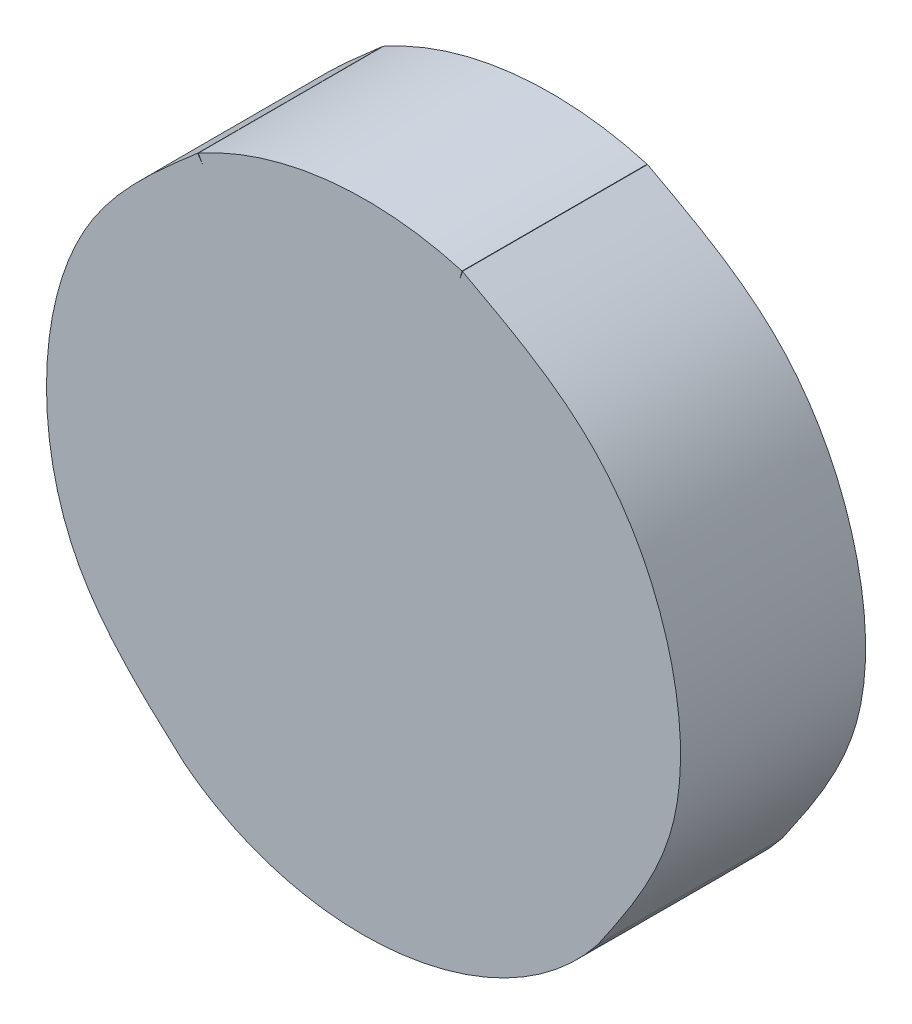
ISO-10303-21;
HEADER;
FILE_DESCRIPTION(('STEP AP214'),'2;1');
FILE_NAME('part.step','',(''),(''),'','','');
FILE_SCHEMA(('AUTOMOTIVE_DESIGN { 1 0 10303 214 1 1 1 1 }'));
ENDSEC;
DATA;
#1=APPLICATION_CONTEXT('core data for automotive mechanical design processes');
#2=APPLICATION_PROTOCOL_DEFINITION('international standard','automotive_design',2000,#1);
#3=PRODUCT_CONTEXT('',#1,'mechanical');
#4=PRODUCT('Part','Part','',(#3));
#5=PRODUCT_RELATED_PRODUCT_CATEGORY('part','',(#4));
#6=PRODUCT_DEFINITION_FORMATION('','',#4);
#7=PRODUCT_DEFINITION_CONTEXT('part definition',#1,'design');
#8=PRODUCT_DEFINITION('design','',#6,#7);
#9=PRODUCT_DEFINITION_SHAPE('','',#8);
#10=(LENGTH_UNIT() NAMED_UNIT(*) SI_UNIT(.MILLI.,.METRE.));
#11=(NAMED_UNIT(*) PLANE_ANGLE_UNIT() SI_UNIT($,.RADIAN.));
#12=(NAMED_UNIT(*) SI_UNIT($,.STERADIAN.) SOLID_ANGLE_UNIT());
#13=UNCERTAINTY_MEASURE_WITH_UNIT(LENGTH_MEASURE(1.E-05),#10,'distance_accuracy_value','');
#14=(GEOMETRIC_REPRESENTATION_CONTEXT(3) GLOBAL_UNCERTAINTY_ASSIGNED_CONTEXT((#13)) GLOBAL_UNIT_ASSIGNED_CONTEXT((#10,
#11,#12)) REPRESENTATION_CONTEXT('',''));
#15=CARTESIAN_POINT('',(0.,0.,0.));
#16=DIRECTION('',(0.,0.,1.));
#17=DIRECTION('',(1.,0.,0.));
#18=AXIS2_PLACEMENT_3D('',#15,#16,#17);
#19=CARTESIAN_POINT('',(611.633949715699,916.431323652917,1315.14694363842));
#20=DIRECTION('',(0.833552068454023,0.552440901070893,0.));
#21=DIRECTION('',(-0.552440901070893,0.833552068454023,0.));
#22=AXIS2_PLACEMENT_3D('',#19,#20,#21);
#23=PLANE('',#22);
#24=CARTESIAN_POINT('',(611.633949715699,916.431323652917,1313.40734896724));
#25=DIRECTION('',(0.552440901070893,-0.833552068454023,0.));
#26=VECTOR('',#25,1.);
#27=LINE('',#24,#26);
#28=CARTESIAN_POINT('',(611.633949715699,916.431323652917,1313.40734896724));
#29=VERTEX_POINT('',#28);
#30=CARTESIAN_POINT('',(611.681242770108,916.359965389526,1313.40734896724));
#31=VERTEX_POINT('',#30);
#32=EDGE_CURVE('E382',#29,#31,#27,.T.);
#33=ORIENTED_EDGE('',*,*,#32,.F.);
#34=CARTESIAN_POINT('',(611.633949715699,916.431323652917,1315.14694363842));
#35=DIRECTION('',(0.,0.,-1.));
#36=VECTOR('',#35,1.);
#37=LINE('',#34,#36);
#38=CARTESIAN_POINT('',(611.633949715699,916.431323652917,1315.14694363842));
#39=VERTEX_POINT('',#38);
#40=EDGE_CURVE('E35',#39,#29,#37,.T.);
#41=ORIENTED_EDGE('',*,*,#40,.F.);
#42=CARTESIAN_POINT('',(611.633949715699,916.431323652917,1315.14694363842));
#43=DIRECTION('',(0.552440901070893,-0.833552068454023,0.));
#44=VECTOR('',#43,1.);
#45=LINE('',#42,#44);
#46=CARTESIAN_POINT('',(611.681242770108,916.359965389526,1315.14694363842));
#47=VERTEX_POINT('',#46);
#48=EDGE_CURVE('E202',#39,#47,#45,.T.);
#49=ORIENTED_EDGE('',*,*,#48,.T.);
#50=CARTESIAN_POINT('',(611.681242770108,916.359965389526,1315.14694363842));
#51=DIRECTION('',(0.,0.,-1.));
#52=VECTOR('',#51,1.);
#53=LINE('',#50,#52);
#54=EDGE_CURVE('E10',#47,#31,#53,.T.);
#55=ORIENTED_EDGE('',*,*,#54,.T.);
#56=EDGE_LOOP('',(#33,#41,#49,#55));
#57=FACE_BOUND('',#56,.T.);
#58=ADVANCED_FACE('F16',(#57),#23,.T.);
#59=CARTESIAN_POINT('',(611.681242770108,916.359965389526,1315.14694363842));
#60=DIRECTION('',(-0.875102101446555,-0.483938334959966,0.));
#61=DIRECTION('',(0.483938334959966,-0.875102101446555,0.));
#62=AXIS2_PLACEMENT_3D('',#59,#60,#61);
#63=PLANE('',#62);
#64=DIRECTION('',(-0.483938334959966,0.875102101446555,5.18750684027987E-12));
#65=VECTOR('',#64,1.);
#66=CARTESIAN_POINT('',(611.681242770108,916.359965389526,1313.40734896724));
#67=LINE('',#66,#65);
#68=CARTESIAN_POINT('',(611.639814045404,916.434880645108,1313.40734896724));
#69=VERTEX_POINT('',#68);
#70=EDGE_CURVE('E384',#31,#69,#67,.T.);
#71=ORIENTED_EDGE('',*,*,#70,.F.);
#72=ORIENTED_EDGE('',*,*,#54,.F.);
#73=DIRECTION('',(-0.483938334959966,0.875102101446555,5.18750684027987E-12));
#74=VECTOR('',#73,1.);
#75=CARTESIAN_POINT('',(611.681242770108,916.359965389526,1315.14694363842));
#76=LINE('',#75,#74);
#77=CARTESIAN_POINT('',(611.639814045404,916.434880645108,1315.14694363842));
#78=VERTEX_POINT('',#77);
#79=EDGE_CURVE('E253',#47,#78,#76,.T.);
#80=ORIENTED_EDGE('',*,*,#79,.T.);
#81=DIRECTION('',(0.,0.,-1.));
#82=VECTOR('',#81,1.);
#83=CARTESIAN_POINT('',(611.639814045404,916.434880645108,1315.14694363842));
#84=LINE('',#83,#82);
#85=EDGE_CURVE('E27',#78,#69,#84,.T.);
#86=ORIENTED_EDGE('',*,*,#85,.T.);
#87=EDGE_LOOP('',(#71,#72,#80,#86));
#88=FACE_BOUND('',#87,.T.);
#89=ADVANCED_FACE('F363',(#88),#63,.T.);
#90=CARTESIAN_POINT('',(613.217746983606,913.581516217434,1315.14694363842));
#91=DIRECTION('',(0.,0.,-1.));
#92=DIRECTION('',(-1.,0.,0.));
#93=AXIS2_PLACEMENT_3D('',#90,#91,#92);
#94=CYLINDRICAL_SURFACE('',#93,3.26060744564273);
#95=CARTESIAN_POINT('',(613.217746983606,913.581516217434,1313.40734896724));
#96=DIRECTION('',(0.,0.,-1.));
#97=DIRECTION('',(-0.48393833496003,0.875102101446519,0.));
#98=AXIS2_PLACEMENT_3D('',#95,#96,#97);
#99=CIRCLE('',#98,3.26060744564273);
#100=CARTESIAN_POINT('',(614.119613291477,916.714916619123,1313.40734896724));
#101=VERTEX_POINT('',#100);
#102=EDGE_CURVE('E400',#69,#101,#99,.T.);
#103=ORIENTED_EDGE('',*,*,#102,.F.);
#104=ORIENTED_EDGE('',*,*,#85,.F.);
#105=CARTESIAN_POINT('',(613.217746983606,913.581516217434,1315.14694363842));
#106=DIRECTION('',(0.,0.,-1.));
#107=DIRECTION('',(-0.48393833496003,0.875102101446519,0.));
#108=AXIS2_PLACEMENT_3D('',#105,#106,#107);
#109=CIRCLE('',#108,3.26060744564273);
#110=CARTESIAN_POINT('',(614.119613291477,916.714916619123,1315.14694363842));
#111=VERTEX_POINT('',#110);
#112=EDGE_CURVE('E292',#78,#111,#109,.T.);
#113=ORIENTED_EDGE('',*,*,#112,.T.);
#114=DIRECTION('',(0.,0.,-1.));
#115=VECTOR('',#114,1.);
#116=CARTESIAN_POINT('',(614.119613291477,916.714916619123,1315.14694363842));
#117=LINE('',#116,#115);
#118=EDGE_CURVE('E229',#111,#101,#117,.T.);
#119=ORIENTED_EDGE('',*,*,#118,.T.);
#120=EDGE_LOOP('',(#103,#104,#113,#119));
#121=FACE_BOUND('',#120,.T.);
#122=ADVANCED_FACE('F371',(#121),#94,.T.);
#123=CARTESIAN_POINT('',(614.119613291477,916.714916619123,1315.14694363842));
#124=DIRECTION('',(0.960986703835268,-0.276594568008533,0.));
#125=DIRECTION('',(0.276594568008533,0.960986703835268,0.));
#126=AXIS2_PLACEMENT_3D('',#123,#124,#125);
#127=PLANE('',#126);
#128=DIRECTION('',(-0.276594568008533,-0.960986703835268,0.));
#129=VECTOR('',#128,1.);
#130=CARTESIAN_POINT('',(614.119613291477,916.714916619123,1313.40734896724));
#131=LINE('',#130,#129);
#132=CARTESIAN_POINT('',(614.095934737031,916.632649002111,1313.40734896724));
#133=VERTEX_POINT('',#132);
#134=EDGE_CURVE('E403',#101,#133,#131,.T.);
#135=ORIENTED_EDGE('',*,*,#134,.F.);
#136=ORIENTED_EDGE('',*,*,#118,.F.);
#137=DIRECTION('',(-0.276594568008533,-0.960986703835268,0.));
#138=VECTOR('',#137,1.);
#139=CARTESIAN_POINT('',(614.119613291477,916.714916619123,1315.14694363842));
#140=LINE('',#139,#138);
#141=CARTESIAN_POINT('',(614.095934737031,916.632649002111,1315.14694363842));
#142=VERTEX_POINT('',#141);
#143=EDGE_CURVE('E296',#111,#142,#140,.T.);
#144=ORIENTED_EDGE('',*,*,#143,.T.);
#145=CARTESIAN_POINT('',(614.095934737031,916.632649002111,1315.14694363842));
#146=DIRECTION('',(0.,0.,-1.));
#147=VECTOR('',#146,1.);
#148=LINE('',#145,#147);
#149=EDGE_CURVE('E234',#142,#133,#148,.T.);
#150=ORIENTED_EDGE('',*,*,#149,.T.);
#151=EDGE_LOOP('',(#135,#136,#144,#150));
#152=FACE_BOUND('',#151,.T.);
#153=ADVANCED_FACE('F322',(#152),#127,.T.);
#154=CARTESIAN_POINT('',(614.122911526417,916.71396730956,1315.14694363842));
#155=DIRECTION('',(-0.94913512246837,0.314869051030667,0.));
#156=DIRECTION('',(-0.314869051030667,-0.94913512246837,0.));
#157=AXIS2_PLACEMENT_3D('',#154,#155,#156);
#158=PLANE('',#157);
#159=CARTESIAN_POINT('',(614.095934737031,916.632649002111,1313.40734896724));
#160=DIRECTION('',(0.314869051030667,0.94913512246837,0.));
#161=VECTOR('',#160,1.);
#162=LINE('',#159,#161);
#163=CARTESIAN_POINT('',(614.122911526417,916.71396730956,1313.40734896724));
#164=VERTEX_POINT('',#163);
#165=EDGE_CURVE('E208',#133,#164,#162,.T.);
#166=ORIENTED_EDGE('',*,*,#165,.F.);
#167=ORIENTED_EDGE('',*,*,#149,.F.);
#168=CARTESIAN_POINT('',(614.095934737031,916.632649002111,1315.14694363842));
#169=DIRECTION('',(0.314869051030667,0.94913512246837,0.));
#170=VECTOR('',#169,1.);
#171=LINE('',#168,#170);
#172=CARTESIAN_POINT('',(614.122911526417,916.71396730956,1315.14694363842));
#173=VERTEX_POINT('',#172);
#174=EDGE_CURVE('E116',#142,#173,#171,.T.);
#175=ORIENTED_EDGE('',*,*,#174,.T.);
#176=CARTESIAN_POINT('',(614.122911526417,916.71396730956,1313.40734896724));
#177=DIRECTION('',(0.,0.,1.));
#178=VECTOR('',#177,1.);
#179=LINE('',#176,#178);
#180=EDGE_CURVE('E104',#173,#164,#179,.F.);
#181=ORIENTED_EDGE('',*,*,#180,.T.);
#182=EDGE_LOOP('',(#166,#167,#175,#181));
#183=FACE_BOUND('',#182,.T.);
#184=ADVANCED_FACE('F303',(#183),#158,.T.);
#185=CARTESIAN_POINT('',(615.392059324852,911.865976538384,1315.14694363842));
#186=CARTESIAN_POINT('',(615.675958760433,912.279594665666,1315.14694363842));
#187=CARTESIAN_POINT('',(616.243551207513,913.106530177318,1315.14694363842));
#188=CARTESIAN_POINT('',(616.165905066954,914.657570066341,1315.14694363842));
#189=CARTESIAN_POINT('',(615.438257129473,916.009246268379,1315.14694363842));
#190=CARTESIAN_POINT('',(614.561503852628,916.478983256651,1315.14694363842));
#191=CARTESIAN_POINT('',(614.122911526417,916.71396730956,1315.14694363842));
#192=B_SPLINE_CURVE_WITH_KNOTS('',3,(#185,#186,#187,#188,#189,#190,#191),.UNSPECIFIED.,.F.,.F.,
(4,1,1,1,4),(0.,0.250519783216939,0.500857412789455,0.750305913627525,1.),.UNSPECIFIED.);
#193=DIRECTION('',(0.,0.,-1.));
#194=VECTOR('',#193,1.);
#195=SURFACE_OF_LINEAR_EXTRUSION('',#192,#194);
#196=CARTESIAN_POINT('',(615.392059324852,911.865976538384,1313.40734896724));
#197=CARTESIAN_POINT('',(615.675958760433,912.279594665666,1313.40734896724));
#198=CARTESIAN_POINT('',(616.243551207513,913.106530177318,1313.40734896724));
#199=CARTESIAN_POINT('',(616.165905066954,914.657570066341,1313.40734896724));
#200=CARTESIAN_POINT('',(615.438257129473,916.009246268379,1313.40734896724));
#201=CARTESIAN_POINT('',(614.561503852628,916.478983256651,1313.40734896724));
#202=CARTESIAN_POINT('',(614.122911526417,916.71396730956,1313.40734896724));
#203=B_SPLINE_CURVE_WITH_KNOTS('',3,(#196,#197,#198,#199,#200,#201,#202),.UNSPECIFIED.,.F.,.F.,
(4,1,1,1,4),(0.,0.250519783216939,0.500857412789455,0.750305913627525,1.),.UNSPECIFIED.);
#204=CARTESIAN_POINT('',(615.392056939565,911.865978598907,1313.40734896724));
#205=VERTEX_POINT('',#204);
#206=EDGE_CURVE('E205',#164,#205,#203,.F.);
#207=ORIENTED_EDGE('',*,*,#206,.F.);
#208=ORIENTED_EDGE('',*,*,#180,.F.);
#209=CARTESIAN_POINT('',(614.122911526417,916.71396730956,1315.14694363842));
#210=CARTESIAN_POINT('',(614.561503852628,916.478983256651,1315.14694363842));
#211=CARTESIAN_POINT('',(615.438257129473,916.009246268379,1315.14694363842));
#212=CARTESIAN_POINT('',(616.165905066954,914.657570066341,1315.14694363842));
#213=CARTESIAN_POINT('',(616.243551207513,913.106530177318,1315.14694363842));
#214=CARTESIAN_POINT('',(615.675958760433,912.279594665666,1315.14694363842));
#215=CARTESIAN_POINT('',(615.392059324852,911.865976538384,1315.14694363842));
#216=B_SPLINE_CURVE_WITH_KNOTS('',3,(#209,#210,#211,#212,#213,#214,#215),.UNSPECIFIED.,.F.,.F.,
(4,1,1,1,4),(0.,0.249694086372475,0.499142587210545,0.749480216783061,1.),.UNSPECIFIED.);
#217=CARTESIAN_POINT('',(615.392056939565,911.865978598907,1315.14694363842));
#218=VERTEX_POINT('',#217);
#219=EDGE_CURVE('E108',#173,#218,#216,.T.);
#220=ORIENTED_EDGE('',*,*,#219,.T.);
#221=CARTESIAN_POINT('',(615.392059324852,911.865976538384,1315.14694363842));
#222=DIRECTION('',(0.,0.,-1.));
#223=VECTOR('',#222,1.);
#224=LINE('',#221,#223);
#225=EDGE_CURVE('E91',#218,#205,#224,.T.);
#226=ORIENTED_EDGE('',*,*,#225,.T.);
#227=EDGE_LOOP('',(#207,#208,#220,#226));
#228=FACE_BOUND('',#227,.T.);
#229=ADVANCED_FACE('F110',(#228),#195,.F.);
#230=CARTESIAN_POINT('',(615.394490207052,911.86906650144,1315.14694363842));
#231=CARTESIAN_POINT('',(614.490291756935,910.719714301164,1315.14694363842));
#232=CARTESIAN_POINT('',(612.654714814609,910.500523135431,1315.14694363842));
#233=CARTESIAN_POINT('',(611.505297267616,911.404772993985,1315.14694363842));
#234=B_SPLINE_CURVE_WITH_KNOTS('',3,(#230,#231,#232,#233),.UNSPECIFIED.,.F.,.F.,(4,4),(0.,1.),.UNSPECIFIED.);
#235=DIRECTION('',(0.,0.,-1.));
#236=VECTOR('',#235,1.);
#237=SURFACE_OF_LINEAR_EXTRUSION('',#234,#236);
#238=CARTESIAN_POINT('',(615.394490207052,911.86906650144,1313.40734896724));
#239=CARTESIAN_POINT('',(614.490291756935,910.719714301164,1313.40734896724));
#240=CARTESIAN_POINT('',(612.654714814609,910.500523135431,1313.40734896724));
#241=CARTESIAN_POINT('',(611.505297267616,911.404772993985,1313.40734896724));
#242=B_SPLINE_CURVE_WITH_KNOTS('',3,(#238,#239,#240,#241),.UNSPECIFIED.,.F.,.F.,(4,4),(0.,1.),.UNSPECIFIED.);
#243=CARTESIAN_POINT('',(611.508387230672,911.402342111784,1313.40734896724));
#244=VERTEX_POINT('',#243);
#245=EDGE_CURVE('E99',#205,#244,#242,.T.);
#246=ORIENTED_EDGE('',*,*,#245,.F.);
#247=ORIENTED_EDGE('',*,*,#225,.F.);
#248=CARTESIAN_POINT('',(611.508387230672,911.402342111784,1315.14694363842));
#249=VERTEX_POINT('',#248);
#250=EDGE_CURVE('E96',#218,#249,#234,.T.);
#251=ORIENTED_EDGE('',*,*,#250,.T.);
#252=CARTESIAN_POINT('',(611.508389174591,911.402344588889,1315.14694363842));
#253=DIRECTION('',(0.,0.,-1.));
#254=VECTOR('',#253,1.);
#255=LINE('',#252,#254);
#256=EDGE_CURVE('E64',#249,#244,#255,.T.);
#257=ORIENTED_EDGE('',*,*,#256,.T.);
#258=EDGE_LOOP('',(#246,#247,#251,#257));
#259=FACE_BOUND('',#258,.T.);
#260=ADVANCED_FACE('F94',(#259),#237,.T.);
#261=CARTESIAN_POINT('',(611.633949715699,916.431323652917,1315.14694363842));
#262=CARTESIAN_POINT('',(611.255984940095,916.102539423113,1315.14694363842));
#263=CARTESIAN_POINT('',(610.500183914434,915.445082765386,1315.14694363842));
#264=CARTESIAN_POINT('',(610.101402871708,913.951222153376,1315.14694363842));
#265=CARTESIAN_POINT('',(610.386309017665,912.41592838494,1315.14694363842));
#266=CARTESIAN_POINT('',(611.134361518222,911.740203878952,1315.14694363842));
#267=CARTESIAN_POINT('',(611.508387230672,911.402342111784,1315.14694363842));
#268=B_SPLINE_CURVE_WITH_KNOTS('',3,(#261,#262,#263,#264,#265,#266,#267),.UNSPECIFIED.,.F.,.F.,
(4,1,1,1,4),(0.,0.249803177235568,0.499521409809185,0.74976106473437,1.),.UNSPECIFIED.);
#269=DIRECTION('',(0.,0.,-1.));
#270=VECTOR('',#269,1.);
#271=SURFACE_OF_LINEAR_EXTRUSION('',#268,#270);
#272=CARTESIAN_POINT('',(611.633949715699,916.431323652917,1313.40734896724));
#273=CARTESIAN_POINT('',(611.255984940095,916.102539423113,1313.40734896724));
#274=CARTESIAN_POINT('',(610.500183914434,915.445082765386,1313.40734896724));
#275=CARTESIAN_POINT('',(610.101402871708,913.951222153376,1313.40734896724));
#276=CARTESIAN_POINT('',(610.386309017665,912.41592838494,1313.40734896724));
#277=CARTESIAN_POINT('',(611.134361518222,911.740203878952,1313.40734896724));
#278=CARTESIAN_POINT('',(611.508387230672,911.402342111784,1313.40734896724));
#279=B_SPLINE_CURVE_WITH_KNOTS('',3,(#272,#273,#274,#275,#276,#277,#278),.UNSPECIFIED.,.F.,.F.,
(4,1,1,1,4),(0.,0.249803177235568,0.499521409809185,0.74976106473437,1.),.UNSPECIFIED.);
#280=EDGE_CURVE('E176',#244,#29,#279,.F.);
#281=ORIENTED_EDGE('',*,*,#280,.F.);
#282=ORIENTED_EDGE('',*,*,#256,.F.);
#283=CARTESIAN_POINT('',(611.508387230672,911.402342111784,1315.14694363842));
#284=CARTESIAN_POINT('',(611.134361518222,911.740203878952,1315.14694363842));
#285=CARTESIAN_POINT('',(610.386309017665,912.41592838494,1315.14694363842));
#286=CARTESIAN_POINT('',(610.101402871708,913.951222153376,1315.14694363842));
#287=CARTESIAN_POINT('',(610.500183914434,915.445082765386,1315.14694363842));
#288=CARTESIAN_POINT('',(611.255984940095,916.102539423113,1315.14694363842));
#289=CARTESIAN_POINT('',(611.633949715699,916.431323652917,1315.14694363842));
#290=B_SPLINE_CURVE_WITH_KNOTS('',3,(#283,#284,#285,#286,#287,#288,#289),.UNSPECIFIED.,.F.,.F.,
(4,1,1,1,4),(0.,0.25023893526563,0.500478590190815,0.750196822764432,1.),.UNSPECIFIED.);
#291=EDGE_CURVE('E121',#249,#39,#290,.T.);
#292=ORIENTED_EDGE('',*,*,#291,.T.);
#293=ORIENTED_EDGE('',*,*,#40,.T.);
#294=EDGE_LOOP('',(#281,#282,#292,#293));
#295=FACE_BOUND('',#294,.T.);
#296=ADVANCED_FACE('F143',(#295),#271,.F.);
#297=CARTESIAN_POINT('',(611.552651456659,911.476454814351,1315.14694363842));
#298=DIRECTION('',(0.,0.,-1.));
#299=DIRECTION('',(0.,1.,0.));
#300=AXIS2_PLACEMENT_3D('',#297,#298,#299);
#301=PLANE('',#300);
#302=ORIENTED_EDGE('',*,*,#48,.F.);
#303=ORIENTED_EDGE('',*,*,#291,.F.);
#304=ORIENTED_EDGE('',*,*,#250,.F.);
#305=ORIENTED_EDGE('',*,*,#219,.F.);
#306=ORIENTED_EDGE('',*,*,#174,.F.);
#307=ORIENTED_EDGE('',*,*,#143,.F.);
#308=ORIENTED_EDGE('',*,*,#112,.F.);
#309=ORIENTED_EDGE('',*,*,#79,.F.);
#310=EDGE_LOOP('',(#302,#303,#304,#305,#306,#307,#308,#309));
#311=FACE_BOUND('',#310,.T.);
#312=ADVANCED_FACE('F120',(#311),#301,.F.);
#313=CARTESIAN_POINT('',(611.552651456659,911.476454814351,1313.40734896724));
#314=DIRECTION('',(0.,0.,-1.));
#315=DIRECTION('',(0.,1.,0.));
#316=AXIS2_PLACEMENT_3D('',#313,#314,#315);
#317=PLANE('',#316);
#318=ORIENTED_EDGE('',*,*,#32,.T.);
#319=ORIENTED_EDGE('',*,*,#70,.T.);
#320=ORIENTED_EDGE('',*,*,#102,.T.);
#321=ORIENTED_EDGE('',*,*,#134,.T.);
#322=ORIENTED_EDGE('',*,*,#165,.T.);
#323=ORIENTED_EDGE('',*,*,#206,.T.);
#324=ORIENTED_EDGE('',*,*,#245,.T.);
#325=ORIENTED_EDGE('',*,*,#280,.T.);
#326=EDGE_LOOP('',(#318,#319,#320,#321,#322,#323,#324,#325));
#327=FACE_BOUND('',#326,.T.);
#328=ADVANCED_FACE('F203',(#327),#317,.T.);
#329=CLOSED_SHELL('',(#58,#89,#122,#153,#184,#229,#260,#296,#312,#328));
#330=MANIFOLD_SOLID_BREP('B1',#329);
#331=ADVANCED_BREP_SHAPE_REPRESENTATION('',(#18,#330),#14);
#332=SHAPE_DEFINITION_REPRESENTATION(#9,#331);
ENDSEC;
END-ISO-10303-21;
